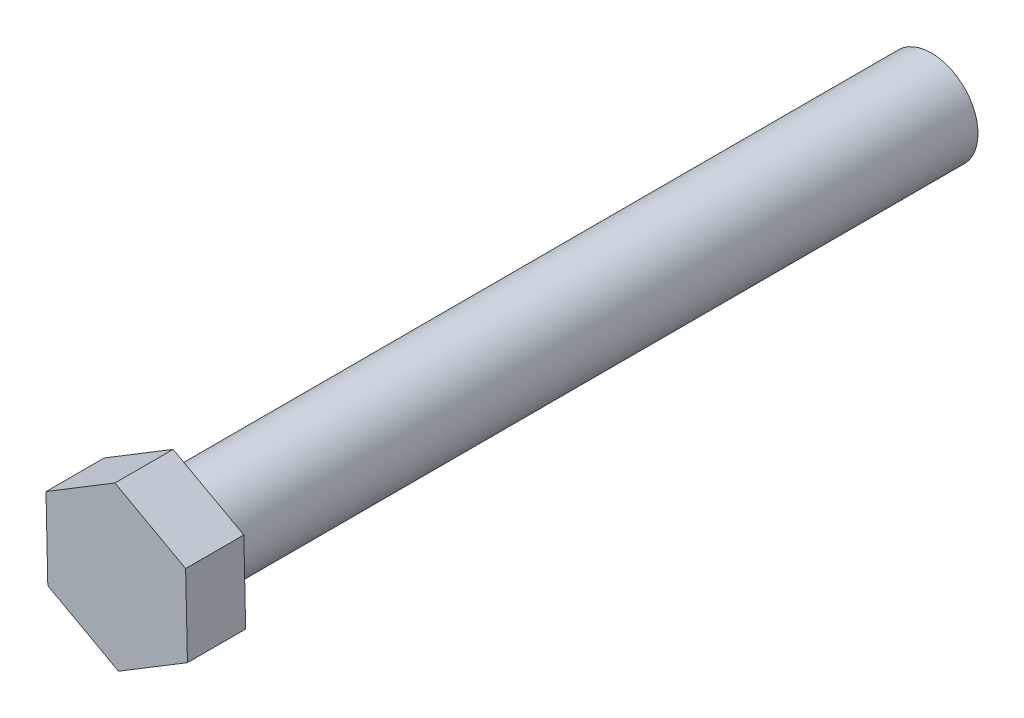
ISO-10303-21;
HEADER;
FILE_DESCRIPTION(('STEP AP214'),'2;1');
FILE_NAME('part.step','',(''),(''),'','','');
FILE_SCHEMA(('AUTOMOTIVE_DESIGN { 1 0 10303 214 1 1 1 1 }'));
ENDSEC;
DATA;
#1=APPLICATION_CONTEXT('core data for automotive mechanical design processes');
#2=APPLICATION_PROTOCOL_DEFINITION('international standard','automotive_design',2000,#1);
#3=PRODUCT_CONTEXT('',#1,'mechanical');
#4=PRODUCT('Part','Part','',(#3));
#5=PRODUCT_RELATED_PRODUCT_CATEGORY('part','',(#4));
#6=PRODUCT_DEFINITION_FORMATION('','',#4);
#7=PRODUCT_DEFINITION_CONTEXT('part definition',#1,'design');
#8=PRODUCT_DEFINITION('design','',#6,#7);
#9=PRODUCT_DEFINITION_SHAPE('','',#8);
#10=(LENGTH_UNIT() NAMED_UNIT(*) SI_UNIT(.MILLI.,.METRE.));
#11=(NAMED_UNIT(*) PLANE_ANGLE_UNIT() SI_UNIT($,.RADIAN.));
#12=(NAMED_UNIT(*) SI_UNIT($,.STERADIAN.) SOLID_ANGLE_UNIT());
#13=UNCERTAINTY_MEASURE_WITH_UNIT(LENGTH_MEASURE(1.E-05),#10,'distance_accuracy_value','');
#14=(GEOMETRIC_REPRESENTATION_CONTEXT(3) GLOBAL_UNCERTAINTY_ASSIGNED_CONTEXT((#13)) GLOBAL_UNIT_ASSIGNED_CONTEXT((#10,
#11,#12)) REPRESENTATION_CONTEXT('',''));
#15=CARTESIAN_POINT('',(0.,0.,0.));
#16=DIRECTION('',(0.,0.,1.));
#17=DIRECTION('',(1.,0.,0.));
#18=AXIS2_PLACEMENT_3D('',#15,#16,#17);
#19=CARTESIAN_POINT('',(0.,0.,65.));
#20=DIRECTION('',(0.,0.,-1.));
#21=DIRECTION('',(-1.,0.,0.));
#22=AXIS2_PLACEMENT_3D('',#19,#20,#21);
#23=CYLINDRICAL_SURFACE('',#22,4.);
#24=CARTESIAN_POINT('',(0.,0.,65.));
#25=DIRECTION('',(0.,0.,1.));
#26=DIRECTION('',(1.,0.,0.));
#27=AXIS2_PLACEMENT_3D('',#24,#25,#26);
#28=CIRCLE('',#27,4.);
#29=CARTESIAN_POINT('',(4.,0.,65.));
#30=VERTEX_POINT('',#29);
#31=EDGE_CURVE('E11',#30,#30,#28,.T.);
#32=ORIENTED_EDGE('',*,*,#31,.F.);
#33=EDGE_LOOP('',(#32));
#34=FACE_BOUND('',#33,.T.);
#35=CARTESIAN_POINT('',(0.,0.,0.));
#36=DIRECTION('',(0.,0.,1.));
#37=DIRECTION('',(1.,0.,0.));
#38=AXIS2_PLACEMENT_3D('',#35,#36,#37);
#39=CIRCLE('',#38,4.);
#40=CARTESIAN_POINT('',(4.,0.,0.));
#41=VERTEX_POINT('',#40);
#42=EDGE_CURVE('E40',#41,#41,#39,.T.);
#43=ORIENTED_EDGE('',*,*,#42,.T.);
#44=EDGE_LOOP('',(#43));
#45=FACE_BOUND('',#44,.T.);
#46=ADVANCED_FACE('F37',(#34,#45),#23,.T.);
#47=CARTESIAN_POINT('',(0.,0.,0.));
#48=DIRECTION('',(0.,0.,1.));
#49=DIRECTION('',(1.,0.,0.));
#50=AXIS2_PLACEMENT_3D('',#47,#48,#49);
#51=PLANE('',#50);
#52=ORIENTED_EDGE('',*,*,#42,.F.);
#53=EDGE_LOOP('',(#52));
#54=FACE_BOUND('',#53,.T.);
#55=ADVANCED_FACE('F134',(#54),#51,.F.);
#56=CARTESIAN_POINT('',(0.155789851531554,-6.92645143794135,70.));
#57=DIRECTION('',(-0.519347306719483,0.854563265652824,0.));
#58=DIRECTION('',(-0.854563265652824,-0.519347306719483,0.));
#59=AXIS2_PLACEMENT_3D('',#56,#57,#58);
#60=PLANE('',#59);
#61=DIRECTION('',(0.854563265652824,0.519347306719483,0.));
#62=VECTOR('',#61,1.);
#63=CARTESIAN_POINT('',(0.155789851531554,-6.92645143794135,65.));
#64=LINE('',#63,#62);
#65=CARTESIAN_POINT('',(0.155789851531554,-6.92645143794135,65.));
#66=VERTEX_POINT('',#65);
#67=CARTESIAN_POINT('',(6.07637782910224,-3.32830774989254,65.));
#68=VERTEX_POINT('',#67);
#69=EDGE_CURVE('E223',#66,#68,#64,.T.);
#70=ORIENTED_EDGE('',*,*,#69,.T.);
#71=DIRECTION('',(0.,0.,-1.));
#72=VECTOR('',#71,1.);
#73=CARTESIAN_POINT('',(6.07637782910224,-3.32830774989254,70.));
#74=LINE('',#73,#72);
#75=CARTESIAN_POINT('',(6.07637782910224,-3.32830774989254,70.));
#76=VERTEX_POINT('',#75);
#77=EDGE_CURVE('E126',#76,#68,#74,.T.);
#78=ORIENTED_EDGE('',*,*,#77,.F.);
#79=DIRECTION('',(0.854563265652824,0.519347306719483,0.));
#80=VECTOR('',#79,1.);
#81=CARTESIAN_POINT('',(0.155789851531554,-6.92645143794135,70.));
#82=LINE('',#81,#80);
#83=CARTESIAN_POINT('',(0.155789851531554,-6.92645143794135,70.));
#84=VERTEX_POINT('',#83);
#85=EDGE_CURVE('E235',#84,#76,#82,.T.);
#86=ORIENTED_EDGE('',*,*,#85,.F.);
#87=DIRECTION('',(0.,0.,-1.));
#88=VECTOR('',#87,1.);
#89=CARTESIAN_POINT('',(0.155789851531554,-6.92645143794135,70.));
#90=LINE('',#89,#88);
#91=EDGE_CURVE('E120',#84,#66,#90,.T.);
#92=ORIENTED_EDGE('',*,*,#91,.T.);
#93=EDGE_LOOP('',(#70,#78,#86,#92));
#94=FACE_BOUND('',#93,.T.);
#95=ADVANCED_FACE('F136',(#94),#60,.F.);
#96=CARTESIAN_POINT('',(6.07637782910224,-3.32830774989254,70.));
#97=DIRECTION('',(-0.999747150556077,-0.0224863281796887,0.));
#98=DIRECTION('',(0.0224863281796887,-0.999747150556077,0.));
#99=AXIS2_PLACEMENT_3D('',#96,#97,#98);
#100=PLANE('',#99);
#101=DIRECTION('',(-0.0224863281796887,0.999747150556077,0.));
#102=VECTOR('',#101,1.);
#103=CARTESIAN_POINT('',(6.07637782910224,-3.32830774989254,65.));
#104=LINE('',#103,#102);
#105=CARTESIAN_POINT('',(5.92058797757069,3.59814368804881,65.));
#106=VERTEX_POINT('',#105);
#107=EDGE_CURVE('E224',#68,#106,#104,.T.);
#108=ORIENTED_EDGE('',*,*,#107,.T.);
#109=DIRECTION('',(0.,0.,-1.));
#110=VECTOR('',#109,1.);
#111=CARTESIAN_POINT('',(5.92058797757069,3.59814368804881,70.));
#112=LINE('',#111,#110);
#113=CARTESIAN_POINT('',(5.92058797757069,3.59814368804881,70.));
#114=VERTEX_POINT('',#113);
#115=EDGE_CURVE('E118',#114,#106,#112,.T.);
#116=ORIENTED_EDGE('',*,*,#115,.F.);
#117=DIRECTION('',(-0.0224863281796887,0.999747150556077,0.));
#118=VECTOR('',#117,1.);
#119=CARTESIAN_POINT('',(6.07637782910224,-3.32830774989254,70.));
#120=LINE('',#119,#118);
#121=EDGE_CURVE('E87',#76,#114,#120,.T.);
#122=ORIENTED_EDGE('',*,*,#121,.F.);
#123=ORIENTED_EDGE('',*,*,#77,.T.);
#124=EDGE_LOOP('',(#108,#116,#122,#123));
#125=FACE_BOUND('',#124,.T.);
#126=ADVANCED_FACE('F141',(#125),#100,.F.);
#127=CARTESIAN_POINT('',(5.92058797757069,3.59814368804881,70.));
#128=DIRECTION('',(-0.480399843836594,-0.877049593832513,0.));
#129=DIRECTION('',(0.877049593832513,-0.480399843836594,0.));
#130=AXIS2_PLACEMENT_3D('',#127,#128,#129);
#131=PLANE('',#130);
#132=DIRECTION('',(-0.877049593832513,0.480399843836594,0.));
#133=VECTOR('',#132,1.);
#134=CARTESIAN_POINT('',(5.92058797757069,3.59814368804881,65.));
#135=LINE('',#134,#133);
#136=CARTESIAN_POINT('',(-0.155789851531555,6.92645143794135,65.));
#137=VERTEX_POINT('',#136);
#138=EDGE_CURVE('E226',#106,#137,#135,.T.);
#139=ORIENTED_EDGE('',*,*,#138,.T.);
#140=DIRECTION('',(0.,0.,-1.));
#141=VECTOR('',#140,1.);
#142=CARTESIAN_POINT('',(-0.155789851531555,6.92645143794135,70.));
#143=LINE('',#142,#141);
#144=CARTESIAN_POINT('',(-0.155789851531555,6.92645143794135,70.));
#145=VERTEX_POINT('',#144);
#146=EDGE_CURVE('E116',#145,#137,#143,.T.);
#147=ORIENTED_EDGE('',*,*,#146,.F.);
#148=DIRECTION('',(-0.877049593832513,0.480399843836594,0.));
#149=VECTOR('',#148,1.);
#150=CARTESIAN_POINT('',(5.92058797757069,3.59814368804881,70.));
#151=LINE('',#150,#149);
#152=EDGE_CURVE('E109',#114,#145,#151,.T.);
#153=ORIENTED_EDGE('',*,*,#152,.F.);
#154=ORIENTED_EDGE('',*,*,#115,.T.);
#155=EDGE_LOOP('',(#139,#147,#153,#154));
#156=FACE_BOUND('',#155,.T.);
#157=ADVANCED_FACE('F148',(#156),#131,.F.);
#158=CARTESIAN_POINT('',(-0.155789851531555,6.92645143794135,70.));
#159=DIRECTION('',(0.519347306719483,-0.854563265652824,0.));
#160=DIRECTION('',(0.854563265652824,0.519347306719483,0.));
#161=AXIS2_PLACEMENT_3D('',#158,#159,#160);
#162=PLANE('',#161);
#163=DIRECTION('',(-0.854563265652824,-0.519347306719483,0.));
#164=VECTOR('',#163,1.);
#165=CARTESIAN_POINT('',(-0.155789851531555,6.92645143794135,65.));
#166=LINE('',#165,#164);
#167=CARTESIAN_POINT('',(-6.07637782910224,3.32830774989254,65.));
#168=VERTEX_POINT('',#167);
#169=EDGE_CURVE('E115',#137,#168,#166,.T.);
#170=ORIENTED_EDGE('',*,*,#169,.T.);
#171=DIRECTION('',(0.,0.,-1.));
#172=VECTOR('',#171,1.);
#173=CARTESIAN_POINT('',(-6.07637782910224,3.32830774989254,70.));
#174=LINE('',#173,#172);
#175=CARTESIAN_POINT('',(-6.07637782910224,3.32830774989254,70.));
#176=VERTEX_POINT('',#175);
#177=EDGE_CURVE('E102',#176,#168,#174,.T.);
#178=ORIENTED_EDGE('',*,*,#177,.F.);
#179=DIRECTION('',(-0.854563265652824,-0.519347306719483,0.));
#180=VECTOR('',#179,1.);
#181=CARTESIAN_POINT('',(-0.155789851531555,6.92645143794135,70.));
#182=LINE('',#181,#180);
#183=EDGE_CURVE('E105',#145,#176,#182,.T.);
#184=ORIENTED_EDGE('',*,*,#183,.F.);
#185=ORIENTED_EDGE('',*,*,#146,.T.);
#186=EDGE_LOOP('',(#170,#178,#184,#185));
#187=FACE_BOUND('',#186,.T.);
#188=ADVANCED_FACE('F114',(#187),#162,.F.);
#189=CARTESIAN_POINT('',(-6.07637782910224,3.32830774989254,70.));
#190=DIRECTION('',(0.999747150556077,0.0224863281796886,0.));
#191=DIRECTION('',(-0.0224863281796886,0.999747150556077,0.));
#192=AXIS2_PLACEMENT_3D('',#189,#190,#191);
#193=PLANE('',#192);
#194=DIRECTION('',(0.0224863281796886,-0.999747150556077,0.));
#195=VECTOR('',#194,1.);
#196=CARTESIAN_POINT('',(-6.07637782910224,3.32830774989254,65.));
#197=LINE('',#196,#195);
#198=CARTESIAN_POINT('',(-5.92058797757069,-3.59814368804881,65.));
#199=VERTEX_POINT('',#198);
#200=EDGE_CURVE('E233',#168,#199,#197,.T.);
#201=ORIENTED_EDGE('',*,*,#200,.T.);
#202=DIRECTION('',(0.,0.,-1.));
#203=VECTOR('',#202,1.);
#204=CARTESIAN_POINT('',(-5.92058797757069,-3.59814368804881,70.));
#205=LINE('',#204,#203);
#206=CARTESIAN_POINT('',(-5.92058797757069,-3.59814368804881,70.));
#207=VERTEX_POINT('',#206);
#208=EDGE_CURVE('E104',#207,#199,#205,.T.);
#209=ORIENTED_EDGE('',*,*,#208,.F.);
#210=DIRECTION('',(0.0224863281796886,-0.999747150556077,0.));
#211=VECTOR('',#210,1.);
#212=CARTESIAN_POINT('',(-6.07637782910224,3.32830774989254,70.));
#213=LINE('',#212,#211);
#214=EDGE_CURVE('E97',#176,#207,#213,.T.);
#215=ORIENTED_EDGE('',*,*,#214,.F.);
#216=ORIENTED_EDGE('',*,*,#177,.T.);
#217=EDGE_LOOP('',(#201,#209,#215,#216));
#218=FACE_BOUND('',#217,.T.);
#219=ADVANCED_FACE('F100',(#218),#193,.F.);
#220=CARTESIAN_POINT('',(-5.92058797757069,-3.59814368804881,70.));
#221=DIRECTION('',(0.480399843836594,0.877049593832513,0.));
#222=DIRECTION('',(-0.877049593832513,0.480399843836595,0.));
#223=AXIS2_PLACEMENT_3D('',#220,#221,#222);
#224=PLANE('',#223);
#225=DIRECTION('',(0.877049593832513,-0.480399843836594,0.));
#226=VECTOR('',#225,1.);
#227=CARTESIAN_POINT('',(-5.92058797757069,-3.59814368804881,65.));
#228=LINE('',#227,#226);
#229=EDGE_CURVE('E75',#199,#66,#228,.T.);
#230=ORIENTED_EDGE('',*,*,#229,.T.);
#231=ORIENTED_EDGE('',*,*,#91,.F.);
#232=DIRECTION('',(0.877049593832513,-0.480399843836594,0.));
#233=VECTOR('',#232,1.);
#234=CARTESIAN_POINT('',(-5.92058797757069,-3.59814368804881,70.));
#235=LINE('',#234,#233);
#236=EDGE_CURVE('E53',#207,#84,#235,.T.);
#237=ORIENTED_EDGE('',*,*,#236,.F.);
#238=ORIENTED_EDGE('',*,*,#208,.T.);
#239=EDGE_LOOP('',(#230,#231,#237,#238));
#240=FACE_BOUND('',#239,.T.);
#241=ADVANCED_FACE('F156',(#240),#224,.F.);
#242=CARTESIAN_POINT('',(0.,0.,70.));
#243=DIRECTION('',(0.,0.,1.));
#244=DIRECTION('',(1.,0.,0.));
#245=AXIS2_PLACEMENT_3D('',#242,#243,#244);
#246=PLANE('',#245);
#247=ORIENTED_EDGE('',*,*,#85,.T.);
#248=ORIENTED_EDGE('',*,*,#121,.T.);
#249=ORIENTED_EDGE('',*,*,#152,.T.);
#250=ORIENTED_EDGE('',*,*,#183,.T.);
#251=ORIENTED_EDGE('',*,*,#214,.T.);
#252=ORIENTED_EDGE('',*,*,#236,.T.);
#253=EDGE_LOOP('',(#247,#248,#249,#250,#251,#252));
#254=FACE_BOUND('',#253,.T.);
#255=ADVANCED_FACE('F108',(#254),#246,.T.);
#256=CARTESIAN_POINT('',(0.,0.,65.));
#257=DIRECTION('',(0.,0.,1.));
#258=DIRECTION('',(1.,0.,0.));
#259=AXIS2_PLACEMENT_3D('',#256,#257,#258);
#260=PLANE('',#259);
#261=ORIENTED_EDGE('',*,*,#31,.T.);
#262=EDGE_LOOP('',(#261));
#263=FACE_BOUND('',#262,.T.);
#264=ORIENTED_EDGE('',*,*,#69,.F.);
#265=ORIENTED_EDGE('',*,*,#229,.F.);
#266=ORIENTED_EDGE('',*,*,#200,.F.);
#267=ORIENTED_EDGE('',*,*,#169,.F.);
#268=ORIENTED_EDGE('',*,*,#138,.F.);
#269=ORIENTED_EDGE('',*,*,#107,.F.);
#270=EDGE_LOOP('',(#264,#265,#266,#267,#268,#269));
#271=FACE_BOUND('',#270,.T.);
#272=ADVANCED_FACE('F159',(#263,#271),#260,.F.);
#273=CLOSED_SHELL('',(#46,#55,#95,#126,#157,#188,#219,#241,#255,#272));
#274=MANIFOLD_SOLID_BREP('B2',#273);
#275=ADVANCED_BREP_SHAPE_REPRESENTATION('',(#18,#274),#14);
#276=SHAPE_DEFINITION_REPRESENTATION(#9,#275);
ENDSEC;
END-ISO-10303-21;
